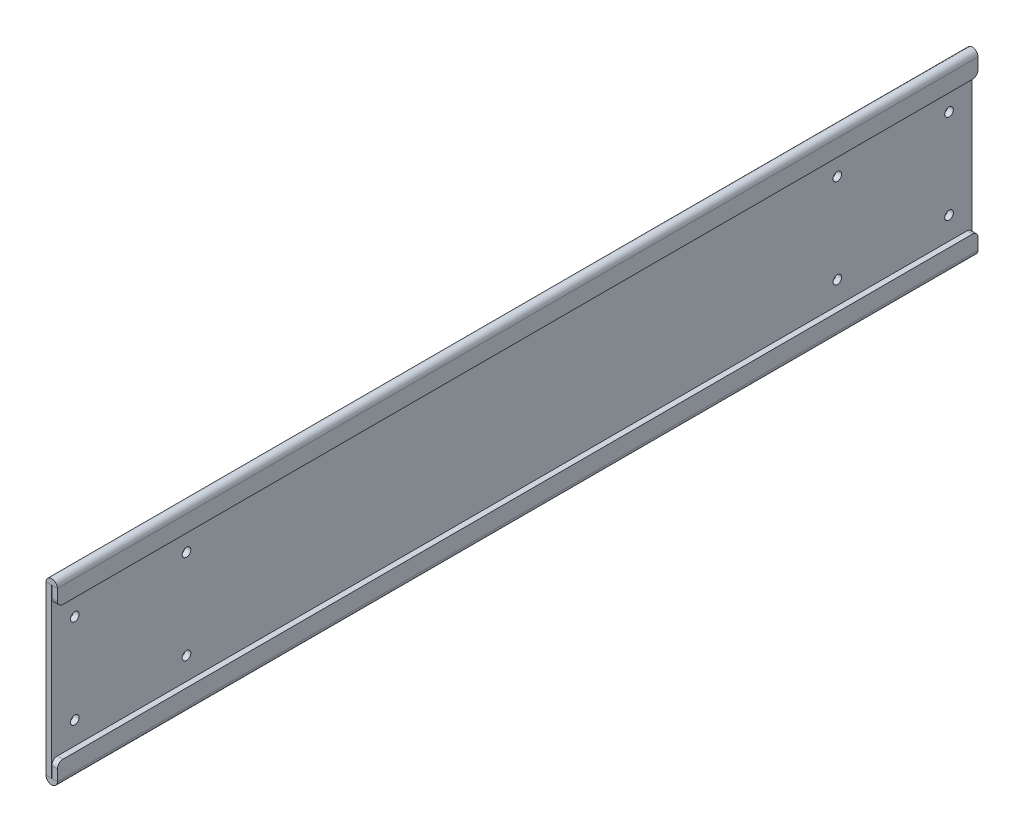
ISO-10303-21;
HEADER;
FILE_DESCRIPTION(('STEP AP214'),'2;1');
FILE_NAME('part.step','',(''),(''),'','','');
FILE_SCHEMA(('AUTOMOTIVE_DESIGN { 1 0 10303 214 1 1 1 1 }'));
ENDSEC;
DATA;
#1=APPLICATION_CONTEXT('core data for automotive mechanical design processes');
#2=APPLICATION_PROTOCOL_DEFINITION('international standard','automotive_design',2000,#1);
#3=PRODUCT_CONTEXT('',#1,'mechanical');
#4=PRODUCT('Part','Part','',(#3));
#5=PRODUCT_RELATED_PRODUCT_CATEGORY('part','',(#4));
#6=PRODUCT_DEFINITION_FORMATION('','',#4);
#7=PRODUCT_DEFINITION_CONTEXT('part definition',#1,'design');
#8=PRODUCT_DEFINITION('design','',#6,#7);
#9=PRODUCT_DEFINITION_SHAPE('','',#8);
#10=(LENGTH_UNIT() NAMED_UNIT(*) SI_UNIT(.MILLI.,.METRE.));
#11=(NAMED_UNIT(*) PLANE_ANGLE_UNIT() SI_UNIT($,.RADIAN.));
#12=(NAMED_UNIT(*) SI_UNIT($,.STERADIAN.) SOLID_ANGLE_UNIT());
#13=UNCERTAINTY_MEASURE_WITH_UNIT(LENGTH_MEASURE(1.E-05),#10,'distance_accuracy_value','');
#14=(GEOMETRIC_REPRESENTATION_CONTEXT(3) GLOBAL_UNCERTAINTY_ASSIGNED_CONTEXT((#13)) GLOBAL_UNIT_ASSIGNED_CONTEXT((#10,
#11,#12)) REPRESENTATION_CONTEXT('',''));
#15=CARTESIAN_POINT('',(0.,0.,0.));
#16=DIRECTION('',(0.,0.,1.));
#17=DIRECTION('',(1.,0.,0.));
#18=AXIS2_PLACEMENT_3D('',#15,#16,#17);
#19=CARTESIAN_POINT('',(-3.175,0.,0.));
#20=DIRECTION('',(0.,0.,-1.));
#21=DIRECTION('',(-1.,0.,0.));
#22=AXIS2_PLACEMENT_3D('',#19,#20,#21);
#23=PLANE('',#22);
#24=DIRECTION('',(0.,1.,0.));
#25=VECTOR('',#24,1.);
#26=CARTESIAN_POINT('',(0.,0.,0.));
#27=LINE('',#26,#25);
#28=CARTESIAN_POINT('',(0.,3.225,0.));
#29=VERTEX_POINT('',#28);
#30=CARTESIAN_POINT('',(0.,98.3749999999999,0.));
#31=VERTEX_POINT('',#30);
#32=EDGE_CURVE('E318',#29,#31,#27,.T.);
#33=ORIENTED_EDGE('',*,*,#32,.F.);
#34=DIRECTION('',(-1.,0.,0.));
#35=VECTOR('',#34,1.);
#36=CARTESIAN_POINT('',(0.,3.225,0.));
#37=LINE('',#36,#35);
#38=CARTESIAN_POINT('',(-3.175,3.225,0.));
#39=VERTEX_POINT('',#38);
#40=EDGE_CURVE('E188',#29,#39,#37,.T.);
#41=ORIENTED_EDGE('',*,*,#40,.T.);
#42=DIRECTION('',(0.,1.,0.));
#43=VECTOR('',#42,1.);
#44=CARTESIAN_POINT('',(-3.175,0.,0.));
#45=LINE('',#44,#43);
#46=CARTESIAN_POINT('',(-3.175,98.3749999999991,0.));
#47=VERTEX_POINT('',#46);
#48=EDGE_CURVE('E167',#39,#47,#45,.T.);
#49=ORIENTED_EDGE('',*,*,#48,.T.);
#50=DIRECTION('',(-1.,-2.7755575615629E-13,0.));
#51=VECTOR('',#50,1.);
#52=CARTESIAN_POINT('',(0.,98.3749999999999,0.));
#53=LINE('',#52,#51);
#54=EDGE_CURVE('E241',#31,#47,#53,.T.);
#55=ORIENTED_EDGE('',*,*,#54,.F.);
#56=EDGE_LOOP('',(#33,#41,#49,#55));
#57=FACE_BOUND('',#56,.T.);
#58=ADVANCED_FACE('F38',(#57),#23,.T.);
#59=CARTESIAN_POINT('',(-3.175,0.,523.3416));
#60=DIRECTION('',(0.,0.,1.));
#61=DIRECTION('',(1.,0.,0.));
#62=AXIS2_PLACEMENT_3D('',#59,#60,#61);
#63=PLANE('',#62);
#64=DIRECTION('',(-1.,0.,0.));
#65=VECTOR('',#64,1.);
#66=CARTESIAN_POINT('',(0.,3.225,523.3416));
#67=LINE('',#66,#65);
#68=CARTESIAN_POINT('',(0.,3.225,523.3416));
#69=VERTEX_POINT('',#68);
#70=CARTESIAN_POINT('',(-3.175,3.22500000000003,523.3416));
#71=VERTEX_POINT('',#70);
#72=EDGE_CURVE('E159',#69,#71,#67,.T.);
#73=ORIENTED_EDGE('',*,*,#72,.F.);
#74=DIRECTION('',(0.,-1.,0.));
#75=VECTOR('',#74,1.);
#76=CARTESIAN_POINT('',(0.,0.,523.3416));
#77=LINE('',#76,#75);
#78=CARTESIAN_POINT('',(0.,98.3749999999999,523.3416));
#79=VERTEX_POINT('',#78);
#80=EDGE_CURVE('E321',#79,#69,#77,.T.);
#81=ORIENTED_EDGE('',*,*,#80,.F.);
#82=DIRECTION('',(-1.,-2.7755575615629E-13,0.));
#83=VECTOR('',#82,1.);
#84=CARTESIAN_POINT('',(0.,98.3749999999999,523.3416));
#85=LINE('',#84,#83);
#86=CARTESIAN_POINT('',(-3.175,98.3749999999999,523.3416));
#87=VERTEX_POINT('',#86);
#88=EDGE_CURVE('E162',#79,#87,#85,.T.);
#89=ORIENTED_EDGE('',*,*,#88,.T.);
#90=DIRECTION('',(0.,-1.,0.));
#91=VECTOR('',#90,1.);
#92=CARTESIAN_POINT('',(-3.175,0.,523.3416));
#93=LINE('',#92,#91);
#94=EDGE_CURVE('E154',#87,#71,#93,.T.);
#95=ORIENTED_EDGE('',*,*,#94,.T.);
#96=EDGE_LOOP('',(#73,#81,#89,#95));
#97=FACE_BOUND('',#96,.T.);
#98=ADVANCED_FACE('F156',(#97),#63,.T.);
#99=CARTESIAN_POINT('',(-3.175,0.,0.));
#100=DIRECTION('',(1.,0.,0.));
#101=DIRECTION('',(0.,0.,-1.));
#102=AXIS2_PLACEMENT_3D('',#99,#100,#101);
#103=PLANE('',#102);
#104=CARTESIAN_POINT('',(-3.175,76.2,13.19149));
#105=DIRECTION('',(1.,0.,0.));
#106=DIRECTION('',(0.,0.,1.));
#107=AXIS2_PLACEMENT_3D('',#104,#105,#106);
#108=CIRCLE('',#107,2.45745000000001);
#109=CARTESIAN_POINT('',(-3.175,76.2,15.64894));
#110=VERTEX_POINT('',#109);
#111=EDGE_CURVE('E273',#110,#110,#108,.T.);
#112=ORIENTED_EDGE('',*,*,#111,.T.);
#113=EDGE_LOOP('',(#112));
#114=FACE_BOUND('',#113,.T.);
#115=CARTESIAN_POINT('',(-3.175,25.4,13.19149));
#116=DIRECTION('',(1.,0.,0.));
#117=DIRECTION('',(0.,0.,1.));
#118=AXIS2_PLACEMENT_3D('',#115,#116,#117);
#119=CIRCLE('',#118,2.45745000000001);
#120=CARTESIAN_POINT('',(-3.175,25.4,15.64894));
#121=VERTEX_POINT('',#120);
#122=EDGE_CURVE('E279',#121,#121,#119,.T.);
#123=ORIENTED_EDGE('',*,*,#122,.T.);
#124=EDGE_LOOP('',(#123));
#125=FACE_BOUND('',#124,.T.);
#126=CARTESIAN_POINT('',(-3.175,25.4,76.69149));
#127=DIRECTION('',(1.,0.,0.));
#128=DIRECTION('',(0.,0.,1.));
#129=AXIS2_PLACEMENT_3D('',#126,#127,#128);
#130=CIRCLE('',#129,2.45745000000001);
#131=CARTESIAN_POINT('',(-3.175,25.4,79.14894));
#132=VERTEX_POINT('',#131);
#133=EDGE_CURVE('E285',#132,#132,#130,.T.);
#134=ORIENTED_EDGE('',*,*,#133,.T.);
#135=EDGE_LOOP('',(#134));
#136=FACE_BOUND('',#135,.T.);
#137=CARTESIAN_POINT('',(-3.175,25.3999999999999,510.15011));
#138=DIRECTION('',(1.,0.,0.));
#139=DIRECTION('',(0.,0.,-1.));
#140=AXIS2_PLACEMENT_3D('',#137,#138,#139);
#141=CIRCLE('',#140,2.45745000000001);
#142=CARTESIAN_POINT('',(-3.175,25.3999999999999,507.69266));
#143=VERTEX_POINT('',#142);
#144=EDGE_CURVE('E291',#143,#143,#141,.T.);
#145=ORIENTED_EDGE('',*,*,#144,.T.);
#146=EDGE_LOOP('',(#145));
#147=FACE_BOUND('',#146,.T.);
#148=CARTESIAN_POINT('',(-3.175,25.3999999999999,446.65011));
#149=DIRECTION('',(1.,0.,0.));
#150=DIRECTION('',(0.,0.,-1.));
#151=AXIS2_PLACEMENT_3D('',#148,#149,#150);
#152=CIRCLE('',#151,2.45745000000002);
#153=CARTESIAN_POINT('',(-3.175,25.3999999999999,444.19266));
#154=VERTEX_POINT('',#153);
#155=EDGE_CURVE('E297',#154,#154,#152,.T.);
#156=ORIENTED_EDGE('',*,*,#155,.T.);
#157=EDGE_LOOP('',(#156));
#158=FACE_BOUND('',#157,.T.);
#159=CARTESIAN_POINT('',(-3.175,76.1999999999999,446.65011));
#160=DIRECTION('',(1.,0.,0.));
#161=DIRECTION('',(0.,0.,-1.));
#162=AXIS2_PLACEMENT_3D('',#159,#160,#161);
#163=CIRCLE('',#162,2.45745000000002);
#164=CARTESIAN_POINT('',(-3.175,76.1999999999999,444.19266));
#165=VERTEX_POINT('',#164);
#166=EDGE_CURVE('E303',#165,#165,#163,.T.);
#167=ORIENTED_EDGE('',*,*,#166,.T.);
#168=EDGE_LOOP('',(#167));
#169=FACE_BOUND('',#168,.T.);
#170=CARTESIAN_POINT('',(-3.175,76.2,76.69149));
#171=DIRECTION('',(1.,0.,0.));
#172=DIRECTION('',(0.,0.,1.));
#173=AXIS2_PLACEMENT_3D('',#170,#171,#172);
#174=CIRCLE('',#173,2.45745000000002);
#175=CARTESIAN_POINT('',(-3.175,76.2,79.14894));
#176=VERTEX_POINT('',#175);
#177=EDGE_CURVE('E309',#176,#176,#174,.T.);
#178=ORIENTED_EDGE('',*,*,#177,.T.);
#179=EDGE_LOOP('',(#178));
#180=FACE_BOUND('',#179,.T.);
#181=CARTESIAN_POINT('',(-3.175,76.1999999999999,510.15011));
#182=DIRECTION('',(1.,0.,0.));
#183=DIRECTION('',(0.,0.,-1.));
#184=AXIS2_PLACEMENT_3D('',#181,#182,#183);
#185=CIRCLE('',#184,2.45745000000001);
#186=CARTESIAN_POINT('',(-3.175,76.1999999999999,507.69266));
#187=VERTEX_POINT('',#186);
#188=EDGE_CURVE('E315',#187,#187,#185,.T.);
#189=ORIENTED_EDGE('',*,*,#188,.T.);
#190=EDGE_LOOP('',(#189));
#191=FACE_BOUND('',#190,.T.);
#192=ORIENTED_EDGE('',*,*,#48,.F.);
#193=DIRECTION('',(0.,0.,-1.));
#194=VECTOR('',#193,1.);
#195=CARTESIAN_POINT('',(-3.175,3.22500000000003,0.));
#196=LINE('',#195,#194);
#197=EDGE_CURVE('E171',#39,#71,#196,.F.);
#198=ORIENTED_EDGE('',*,*,#197,.T.);
#199=ORIENTED_EDGE('',*,*,#94,.F.);
#200=DIRECTION('',(0.,0.,1.));
#201=VECTOR('',#200,1.);
#202=CARTESIAN_POINT('',(-3.175,98.3749999999991,523.3416));
#203=LINE('',#202,#201);
#204=EDGE_CURVE('E225',#87,#47,#203,.F.);
#205=ORIENTED_EDGE('',*,*,#204,.T.);
#206=EDGE_LOOP('',(#192,#198,#199,#205));
#207=FACE_BOUND('',#206,.T.);
#208=ADVANCED_FACE('F172',(#114,#125,#136,#147,#158,#169,#180,#191,#207),#103,.F.);
#209=CARTESIAN_POINT('',(0.,0.,0.));
#210=DIRECTION('',(1.,0.,0.));
#211=DIRECTION('',(0.,0.,-1.));
#212=AXIS2_PLACEMENT_3D('',#209,#210,#211);
#213=PLANE('',#212);
#214=DIRECTION('',(0.,0.,-1.));
#215=VECTOR('',#214,1.);
#216=CARTESIAN_POINT('',(0.,3.225,0.));
#217=LINE('',#216,#215);
#218=EDGE_CURVE('E199',#29,#69,#217,.F.);
#219=ORIENTED_EDGE('',*,*,#218,.F.);
#220=ORIENTED_EDGE('',*,*,#32,.T.);
#221=DIRECTION('',(0.,0.,1.));
#222=VECTOR('',#221,1.);
#223=CARTESIAN_POINT('',(0.,98.3749999999999,523.3416));
#224=LINE('',#223,#222);
#225=EDGE_CURVE('E236',#79,#31,#224,.F.);
#226=ORIENTED_EDGE('',*,*,#225,.F.);
#227=ORIENTED_EDGE('',*,*,#80,.T.);
#228=EDGE_LOOP('',(#219,#220,#226,#227));
#229=FACE_BOUND('',#228,.T.);
#230=CARTESIAN_POINT('',(0.,76.2,13.19149));
#231=DIRECTION('',(1.,0.,0.));
#232=DIRECTION('',(0.,0.,1.));
#233=AXIS2_PLACEMENT_3D('',#230,#231,#232);
#234=CIRCLE('',#233,2.45745000000001);
#235=CARTESIAN_POINT('',(0.,76.2,15.64894));
#236=VERTEX_POINT('',#235);
#237=EDGE_CURVE('E272',#236,#236,#234,.T.);
#238=ORIENTED_EDGE('',*,*,#237,.F.);
#239=EDGE_LOOP('',(#238));
#240=FACE_BOUND('',#239,.T.);
#241=CARTESIAN_POINT('',(0.,25.4,13.19149));
#242=DIRECTION('',(1.,0.,0.));
#243=DIRECTION('',(0.,0.,1.));
#244=AXIS2_PLACEMENT_3D('',#241,#242,#243);
#245=CIRCLE('',#244,2.45745000000001);
#246=CARTESIAN_POINT('',(0.,25.4,15.64894));
#247=VERTEX_POINT('',#246);
#248=EDGE_CURVE('E276',#247,#247,#245,.T.);
#249=ORIENTED_EDGE('',*,*,#248,.F.);
#250=EDGE_LOOP('',(#249));
#251=FACE_BOUND('',#250,.T.);
#252=CARTESIAN_POINT('',(0.,25.4,76.69149));
#253=DIRECTION('',(1.,0.,0.));
#254=DIRECTION('',(0.,0.,1.));
#255=AXIS2_PLACEMENT_3D('',#252,#253,#254);
#256=CIRCLE('',#255,2.45745000000001);
#257=CARTESIAN_POINT('',(0.,25.4,79.14894));
#258=VERTEX_POINT('',#257);
#259=EDGE_CURVE('E282',#258,#258,#256,.T.);
#260=ORIENTED_EDGE('',*,*,#259,.F.);
#261=EDGE_LOOP('',(#260));
#262=FACE_BOUND('',#261,.T.);
#263=CARTESIAN_POINT('',(0.,25.3999999999999,510.15011));
#264=DIRECTION('',(1.,0.,0.));
#265=DIRECTION('',(0.,0.,-1.));
#266=AXIS2_PLACEMENT_3D('',#263,#264,#265);
#267=CIRCLE('',#266,2.45745000000001);
#268=CARTESIAN_POINT('',(0.,25.3999999999999,507.69266));
#269=VERTEX_POINT('',#268);
#270=EDGE_CURVE('E288',#269,#269,#267,.T.);
#271=ORIENTED_EDGE('',*,*,#270,.F.);
#272=EDGE_LOOP('',(#271));
#273=FACE_BOUND('',#272,.T.);
#274=CARTESIAN_POINT('',(0.,25.3999999999999,446.65011));
#275=DIRECTION('',(1.,0.,0.));
#276=DIRECTION('',(0.,0.,-1.));
#277=AXIS2_PLACEMENT_3D('',#274,#275,#276);
#278=CIRCLE('',#277,2.45745000000002);
#279=CARTESIAN_POINT('',(0.,25.3999999999999,444.19266));
#280=VERTEX_POINT('',#279);
#281=EDGE_CURVE('E294',#280,#280,#278,.T.);
#282=ORIENTED_EDGE('',*,*,#281,.F.);
#283=EDGE_LOOP('',(#282));
#284=FACE_BOUND('',#283,.T.);
#285=CARTESIAN_POINT('',(0.,76.1999999999999,446.65011));
#286=DIRECTION('',(1.,0.,0.));
#287=DIRECTION('',(0.,0.,-1.));
#288=AXIS2_PLACEMENT_3D('',#285,#286,#287);
#289=CIRCLE('',#288,2.45745000000002);
#290=CARTESIAN_POINT('',(0.,76.1999999999999,444.19266));
#291=VERTEX_POINT('',#290);
#292=EDGE_CURVE('E300',#291,#291,#289,.T.);
#293=ORIENTED_EDGE('',*,*,#292,.F.);
#294=EDGE_LOOP('',(#293));
#295=FACE_BOUND('',#294,.T.);
#296=CARTESIAN_POINT('',(0.,76.2,76.69149));
#297=DIRECTION('',(1.,0.,0.));
#298=DIRECTION('',(0.,0.,1.));
#299=AXIS2_PLACEMENT_3D('',#296,#297,#298);
#300=CIRCLE('',#299,2.45745000000002);
#301=CARTESIAN_POINT('',(0.,76.2,79.14894));
#302=VERTEX_POINT('',#301);
#303=EDGE_CURVE('E306',#302,#302,#300,.T.);
#304=ORIENTED_EDGE('',*,*,#303,.F.);
#305=EDGE_LOOP('',(#304));
#306=FACE_BOUND('',#305,.T.);
#307=CARTESIAN_POINT('',(0.,76.1999999999999,510.15011));
#308=DIRECTION('',(1.,0.,0.));
#309=DIRECTION('',(0.,0.,-1.));
#310=AXIS2_PLACEMENT_3D('',#307,#308,#309);
#311=CIRCLE('',#310,2.45745000000001);
#312=CARTESIAN_POINT('',(0.,76.1999999999999,507.69266));
#313=VERTEX_POINT('',#312);
#314=EDGE_CURVE('E312',#313,#313,#311,.T.);
#315=ORIENTED_EDGE('',*,*,#314,.F.);
#316=EDGE_LOOP('',(#315));
#317=FACE_BOUND('',#316,.T.);
#318=ADVANCED_FACE('F379',(#229,#240,#251,#262,#273,#284,#295,#306,#317),#213,.T.);
#319=CARTESIAN_POINT('',(-3.175,76.1999999999999,510.15011));
#320=DIRECTION('',(1.,0.,0.));
#321=DIRECTION('',(0.,0.,-1.));
#322=AXIS2_PLACEMENT_3D('',#319,#320,#321);
#323=CYLINDRICAL_SURFACE('',#322,2.45745000000001);
#324=ORIENTED_EDGE('',*,*,#188,.F.);
#325=EDGE_LOOP('',(#324));
#326=FACE_BOUND('',#325,.T.);
#327=ORIENTED_EDGE('',*,*,#314,.T.);
#328=EDGE_LOOP('',(#327));
#329=FACE_BOUND('',#328,.T.);
#330=ADVANCED_FACE('F494',(#326,#329),#323,.F.);
#331=CARTESIAN_POINT('',(-3.175,76.2,76.69149));
#332=DIRECTION('',(1.,0.,0.));
#333=DIRECTION('',(0.,0.,-1.));
#334=AXIS2_PLACEMENT_3D('',#331,#332,#333);
#335=CYLINDRICAL_SURFACE('',#334,2.45745000000002);
#336=ORIENTED_EDGE('',*,*,#177,.F.);
#337=EDGE_LOOP('',(#336));
#338=FACE_BOUND('',#337,.T.);
#339=ORIENTED_EDGE('',*,*,#303,.T.);
#340=EDGE_LOOP('',(#339));
#341=FACE_BOUND('',#340,.T.);
#342=ADVANCED_FACE('F490',(#338,#341),#335,.F.);
#343=CARTESIAN_POINT('',(-3.175,76.1999999999999,446.65011));
#344=DIRECTION('',(1.,0.,0.));
#345=DIRECTION('',(0.,0.,-1.));
#346=AXIS2_PLACEMENT_3D('',#343,#344,#345);
#347=CYLINDRICAL_SURFACE('',#346,2.45745000000002);
#348=ORIENTED_EDGE('',*,*,#166,.F.);
#349=EDGE_LOOP('',(#348));
#350=FACE_BOUND('',#349,.T.);
#351=ORIENTED_EDGE('',*,*,#292,.T.);
#352=EDGE_LOOP('',(#351));
#353=FACE_BOUND('',#352,.T.);
#354=ADVANCED_FACE('F486',(#350,#353),#347,.F.);
#355=CARTESIAN_POINT('',(-3.175,25.3999999999999,446.65011));
#356=DIRECTION('',(1.,0.,0.));
#357=DIRECTION('',(0.,0.,-1.));
#358=AXIS2_PLACEMENT_3D('',#355,#356,#357);
#359=CYLINDRICAL_SURFACE('',#358,2.45745000000002);
#360=ORIENTED_EDGE('',*,*,#155,.F.);
#361=EDGE_LOOP('',(#360));
#362=FACE_BOUND('',#361,.T.);
#363=ORIENTED_EDGE('',*,*,#281,.T.);
#364=EDGE_LOOP('',(#363));
#365=FACE_BOUND('',#364,.T.);
#366=ADVANCED_FACE('F482',(#362,#365),#359,.F.);
#367=CARTESIAN_POINT('',(-3.175,25.3999999999999,510.15011));
#368=DIRECTION('',(1.,0.,0.));
#369=DIRECTION('',(0.,0.,-1.));
#370=AXIS2_PLACEMENT_3D('',#367,#368,#369);
#371=CYLINDRICAL_SURFACE('',#370,2.45745000000001);
#372=ORIENTED_EDGE('',*,*,#144,.F.);
#373=EDGE_LOOP('',(#372));
#374=FACE_BOUND('',#373,.T.);
#375=ORIENTED_EDGE('',*,*,#270,.T.);
#376=EDGE_LOOP('',(#375));
#377=FACE_BOUND('',#376,.T.);
#378=ADVANCED_FACE('F478',(#374,#377),#371,.F.);
#379=CARTESIAN_POINT('',(-3.175,25.4,76.69149));
#380=DIRECTION('',(1.,0.,0.));
#381=DIRECTION('',(0.,0.,-1.));
#382=AXIS2_PLACEMENT_3D('',#379,#380,#381);
#383=CYLINDRICAL_SURFACE('',#382,2.45745000000001);
#384=ORIENTED_EDGE('',*,*,#133,.F.);
#385=EDGE_LOOP('',(#384));
#386=FACE_BOUND('',#385,.T.);
#387=ORIENTED_EDGE('',*,*,#259,.T.);
#388=EDGE_LOOP('',(#387));
#389=FACE_BOUND('',#388,.T.);
#390=ADVANCED_FACE('F474',(#386,#389),#383,.F.);
#391=CARTESIAN_POINT('',(-3.175,25.4,13.19149));
#392=DIRECTION('',(1.,0.,0.));
#393=DIRECTION('',(0.,0.,-1.));
#394=AXIS2_PLACEMENT_3D('',#391,#392,#393);
#395=CYLINDRICAL_SURFACE('',#394,2.45745000000001);
#396=ORIENTED_EDGE('',*,*,#122,.F.);
#397=EDGE_LOOP('',(#396));
#398=FACE_BOUND('',#397,.T.);
#399=ORIENTED_EDGE('',*,*,#248,.T.);
#400=EDGE_LOOP('',(#399));
#401=FACE_BOUND('',#400,.T.);
#402=ADVANCED_FACE('F470',(#398,#401),#395,.F.);
#403=CARTESIAN_POINT('',(-3.175,76.2,13.19149));
#404=DIRECTION('',(1.,0.,0.));
#405=DIRECTION('',(0.,0.,-1.));
#406=AXIS2_PLACEMENT_3D('',#403,#404,#405);
#407=CYLINDRICAL_SURFACE('',#406,2.45745000000001);
#408=ORIENTED_EDGE('',*,*,#111,.F.);
#409=EDGE_LOOP('',(#408));
#410=FACE_BOUND('',#409,.T.);
#411=ORIENTED_EDGE('',*,*,#237,.T.);
#412=EDGE_LOOP('',(#411));
#413=FACE_BOUND('',#412,.T.);
#414=ADVANCED_FACE('F466',(#410,#413),#407,.F.);
#415=CARTESIAN_POINT('',(3.275,93.6374999999999,523.3416));
#416=DIRECTION('',(0.,0.,-1.));
#417=DIRECTION('',(0.,1.,0.));
#418=AXIS2_PLACEMENT_3D('',#415,#416,#417);
#419=PLANE('',#418);
#420=DIRECTION('',(0.,1.,0.));
#421=VECTOR('',#420,1.);
#422=CARTESIAN_POINT('',(0.0999999999999998,93.6375,523.3416));
#423=LINE('',#422,#421);
#424=CARTESIAN_POINT('',(0.0999999999999998,92.0749999999999,523.3416));
#425=VERTEX_POINT('',#424);
#426=CARTESIAN_POINT('',(0.0999999999999998,98.3749999999999,523.3416));
#427=VERTEX_POINT('',#426);
#428=EDGE_CURVE('E261',#425,#427,#423,.T.);
#429=ORIENTED_EDGE('',*,*,#428,.F.);
#430=DIRECTION('',(-1.,0.,0.));
#431=VECTOR('',#430,1.);
#432=CARTESIAN_POINT('',(3.275,92.0749999999999,523.3416));
#433=LINE('',#432,#431);
#434=CARTESIAN_POINT('',(3.275,92.0749999999999,523.3416));
#435=VERTEX_POINT('',#434);
#436=EDGE_CURVE('E11',#425,#435,#433,.F.);
#437=ORIENTED_EDGE('',*,*,#436,.T.);
#438=DIRECTION('',(0.,1.,0.));
#439=VECTOR('',#438,1.);
#440=CARTESIAN_POINT('',(3.275,93.6374999999999,523.3416));
#441=LINE('',#440,#439);
#442=CARTESIAN_POINT('',(3.275,98.3749999999999,523.3416));
#443=VERTEX_POINT('',#442);
#444=EDGE_CURVE('E250',#435,#443,#441,.T.);
#445=ORIENTED_EDGE('',*,*,#444,.T.);
#446=DIRECTION('',(1.,0.,0.));
#447=VECTOR('',#446,1.);
#448=CARTESIAN_POINT('',(3.275,98.3749999999999,523.3416));
#449=LINE('',#448,#447);
#450=EDGE_CURVE('E249',#427,#443,#449,.T.);
#451=ORIENTED_EDGE('',*,*,#450,.F.);
#452=EDGE_LOOP('',(#429,#437,#445,#451));
#453=FACE_BOUND('',#452,.T.);
#454=ADVANCED_FACE('F424',(#453),#419,.F.);
#455=CARTESIAN_POINT('',(3.275,88.8999999999999,261.6708));
#456=DIRECTION('',(0.,1.,0.));
#457=DIRECTION('',(0.,0.,1.));
#458=AXIS2_PLACEMENT_3D('',#455,#456,#457);
#459=PLANE('',#458);
#460=DIRECTION('',(0.,0.,-1.));
#461=VECTOR('',#460,1.);
#462=CARTESIAN_POINT('',(0.0999999999999998,88.9,261.6708));
#463=LINE('',#462,#461);
#464=CARTESIAN_POINT('',(0.0999999999999998,88.9,3.17499999999998));
#465=VERTEX_POINT('',#464);
#466=CARTESIAN_POINT('',(0.0999999999999998,88.9,520.1666));
#467=VERTEX_POINT('',#466);
#468=EDGE_CURVE('E258',#465,#467,#463,.F.);
#469=ORIENTED_EDGE('',*,*,#468,.F.);
#470=DIRECTION('',(-1.,0.,0.));
#471=VECTOR('',#470,1.);
#472=CARTESIAN_POINT('',(3.275,88.9,3.17499999999998));
#473=LINE('',#472,#471);
#474=CARTESIAN_POINT('',(3.275,88.9,3.17499999999998));
#475=VERTEX_POINT('',#474);
#476=EDGE_CURVE('E326',#465,#475,#473,.F.);
#477=ORIENTED_EDGE('',*,*,#476,.T.);
#478=DIRECTION('',(0.,0.,1.));
#479=VECTOR('',#478,1.);
#480=CARTESIAN_POINT('',(3.275,88.8999999999999,261.6708));
#481=LINE('',#480,#479);
#482=CARTESIAN_POINT('',(3.275,88.8999999999999,520.1666));
#483=VERTEX_POINT('',#482);
#484=EDGE_CURVE('E246',#475,#483,#481,.T.);
#485=ORIENTED_EDGE('',*,*,#484,.T.);
#486=DIRECTION('',(-1.,0.,0.));
#487=VECTOR('',#486,1.);
#488=CARTESIAN_POINT('',(3.275,88.8999999999999,520.1666));
#489=LINE('',#488,#487);
#490=EDGE_CURVE('E166',#483,#467,#489,.T.);
#491=ORIENTED_EDGE('',*,*,#490,.T.);
#492=EDGE_LOOP('',(#469,#477,#485,#491));
#493=FACE_BOUND('',#492,.T.);
#494=ADVANCED_FACE('F449',(#493),#459,.F.);
#495=CARTESIAN_POINT('',(3.275,93.6375,0.));
#496=DIRECTION('',(0.,0.,1.));
#497=DIRECTION('',(0.,-1.,0.));
#498=AXIS2_PLACEMENT_3D('',#495,#496,#497);
#499=PLANE('',#498);
#500=DIRECTION('',(0.,-1.,0.));
#501=VECTOR('',#500,1.);
#502=CARTESIAN_POINT('',(3.275,93.6375,0.));
#503=LINE('',#502,#501);
#504=CARTESIAN_POINT('',(3.275,98.3749999999999,0.));
#505=VERTEX_POINT('',#504);
#506=CARTESIAN_POINT('',(3.275,92.075,0.));
#507=VERTEX_POINT('',#506);
#508=EDGE_CURVE('E255',#505,#507,#503,.T.);
#509=ORIENTED_EDGE('',*,*,#508,.T.);
#510=DIRECTION('',(-1.,0.,0.));
#511=VECTOR('',#510,1.);
#512=CARTESIAN_POINT('',(3.275,92.075,0.));
#513=LINE('',#512,#511);
#514=CARTESIAN_POINT('',(0.0999999999999998,92.075,0.));
#515=VERTEX_POINT('',#514);
#516=EDGE_CURVE('E333',#507,#515,#513,.T.);
#517=ORIENTED_EDGE('',*,*,#516,.T.);
#518=DIRECTION('',(0.,1.,0.));
#519=VECTOR('',#518,1.);
#520=CARTESIAN_POINT('',(0.0999999999999998,93.6375,0.));
#521=LINE('',#520,#519);
#522=CARTESIAN_POINT('',(0.0999999999999998,98.375,0.));
#523=VERTEX_POINT('',#522);
#524=EDGE_CURVE('E244',#523,#515,#521,.F.);
#525=ORIENTED_EDGE('',*,*,#524,.F.);
#526=DIRECTION('',(1.,0.,0.));
#527=VECTOR('',#526,1.);
#528=CARTESIAN_POINT('',(3.275,98.375,0.));
#529=LINE('',#528,#527);
#530=EDGE_CURVE('E269',#523,#505,#529,.T.);
#531=ORIENTED_EDGE('',*,*,#530,.T.);
#532=EDGE_LOOP('',(#509,#517,#525,#531));
#533=FACE_BOUND('',#532,.T.);
#534=ADVANCED_FACE('F443',(#533),#499,.F.);
#535=CARTESIAN_POINT('',(3.275,93.6375,261.6708));
#536=DIRECTION('',(1.,0.,0.));
#537=DIRECTION('',(0.,0.,-1.));
#538=AXIS2_PLACEMENT_3D('',#535,#536,#537);
#539=PLANE('',#538);
#540=ORIENTED_EDGE('',*,*,#484,.F.);
#541=CARTESIAN_POINT('',(3.275,92.075,3.17499999999998));
#542=DIRECTION('',(1.,0.,0.));
#543=DIRECTION('',(0.,0.,-1.));
#544=AXIS2_PLACEMENT_3D('',#541,#542,#543);
#545=CIRCLE('',#544,3.175);
#546=EDGE_CURVE('E331',#475,#507,#545,.T.);
#547=ORIENTED_EDGE('',*,*,#546,.T.);
#548=ORIENTED_EDGE('',*,*,#508,.F.);
#549=DIRECTION('',(0.,0.,-1.));
#550=VECTOR('',#549,1.);
#551=CARTESIAN_POINT('',(3.275,98.375,261.6708));
#552=LINE('',#551,#550);
#553=EDGE_CURVE('E252',#443,#505,#552,.T.);
#554=ORIENTED_EDGE('',*,*,#553,.F.);
#555=ORIENTED_EDGE('',*,*,#444,.F.);
#556=CARTESIAN_POINT('',(3.275,92.0749999999999,520.1666));
#557=DIRECTION('',(1.,0.,0.));
#558=DIRECTION('',(0.,0.,-1.));
#559=AXIS2_PLACEMENT_3D('',#556,#557,#558);
#560=CIRCLE('',#559,3.175);
#561=EDGE_CURVE('E329',#435,#483,#560,.T.);
#562=ORIENTED_EDGE('',*,*,#561,.T.);
#563=EDGE_LOOP('',(#540,#547,#548,#554,#555,#562));
#564=FACE_BOUND('',#563,.T.);
#565=ADVANCED_FACE('F451',(#564),#539,.T.);
#566=CARTESIAN_POINT('',(0.0999999999999998,93.6375,261.6708));
#567=DIRECTION('',(1.,0.,0.));
#568=DIRECTION('',(0.,0.,-1.));
#569=AXIS2_PLACEMENT_3D('',#566,#567,#568);
#570=PLANE('',#569);
#571=ORIENTED_EDGE('',*,*,#524,.T.);
#572=CARTESIAN_POINT('',(0.0999999999999998,92.075,3.17499999999998));
#573=DIRECTION('',(1.,0.,0.));
#574=DIRECTION('',(0.,0.,-1.));
#575=AXIS2_PLACEMENT_3D('',#572,#573,#574);
#576=CIRCLE('',#575,3.175);
#577=EDGE_CURVE('E337',#515,#465,#576,.F.);
#578=ORIENTED_EDGE('',*,*,#577,.T.);
#579=ORIENTED_EDGE('',*,*,#468,.T.);
#580=CARTESIAN_POINT('',(0.0999999999999998,92.0749999999999,520.1666));
#581=DIRECTION('',(1.,0.,0.));
#582=DIRECTION('',(0.,0.,-1.));
#583=AXIS2_PLACEMENT_3D('',#580,#581,#582);
#584=CIRCLE('',#583,3.175);
#585=EDGE_CURVE('E335',#467,#425,#584,.F.);
#586=ORIENTED_EDGE('',*,*,#585,.T.);
#587=ORIENTED_EDGE('',*,*,#428,.T.);
#588=DIRECTION('',(0.,0.,-1.));
#589=VECTOR('',#588,1.);
#590=CARTESIAN_POINT('',(0.0999999999999998,98.3749999999999,261.6708));
#591=LINE('',#590,#589);
#592=EDGE_CURVE('E263',#427,#523,#591,.T.);
#593=ORIENTED_EDGE('',*,*,#592,.T.);
#594=EDGE_LOOP('',(#571,#578,#579,#586,#587,#593));
#595=FACE_BOUND('',#594,.T.);
#596=ADVANCED_FACE('F420',(#595),#570,.F.);
#597=CARTESIAN_POINT('',(0.0499999999999999,98.3749999999999,0.));
#598=DIRECTION('',(0.,0.,-1.));
#599=DIRECTION('',(-1.,0.,0.));
#600=AXIS2_PLACEMENT_3D('',#597,#598,#599);
#601=PLANE('',#600);
#602=ORIENTED_EDGE('',*,*,#530,.F.);
#603=CARTESIAN_POINT('',(0.0499999999999999,98.3749999999999,0.));
#604=DIRECTION('',(0.,0.,1.));
#605=DIRECTION('',(1.,0.,0.));
#606=AXIS2_PLACEMENT_3D('',#603,#604,#605);
#607=CIRCLE('',#606,0.0499999999999999);
#608=EDGE_CURVE('E233',#31,#523,#607,.F.);
#609=ORIENTED_EDGE('',*,*,#608,.F.);
#610=ORIENTED_EDGE('',*,*,#54,.T.);
#611=CARTESIAN_POINT('',(0.0499999999999999,98.3749999999999,0.));
#612=DIRECTION('',(0.,0.,1.));
#613=DIRECTION('',(1.,0.,0.));
#614=AXIS2_PLACEMENT_3D('',#611,#612,#613);
#615=CIRCLE('',#614,3.225);
#616=EDGE_CURVE('E227',#47,#505,#615,.F.);
#617=ORIENTED_EDGE('',*,*,#616,.T.);
#618=EDGE_LOOP('',(#602,#609,#610,#617));
#619=FACE_BOUND('',#618,.T.);
#620=ADVANCED_FACE('F441',(#619),#601,.T.);
#621=CARTESIAN_POINT('',(0.0499999999999999,98.3749999999999,523.3416));
#622=DIRECTION('',(0.,0.,-1.));
#623=DIRECTION('',(-1.,0.,0.));
#624=AXIS2_PLACEMENT_3D('',#621,#622,#623);
#625=PLANE('',#624);
#626=CARTESIAN_POINT('',(0.0499999999999999,98.3749999999999,523.3416));
#627=DIRECTION('',(0.,0.,1.));
#628=DIRECTION('',(1.,0.,0.));
#629=AXIS2_PLACEMENT_3D('',#626,#627,#628);
#630=CIRCLE('',#629,0.0499999999999999);
#631=EDGE_CURVE('E224',#427,#79,#630,.T.);
#632=ORIENTED_EDGE('',*,*,#631,.F.);
#633=ORIENTED_EDGE('',*,*,#450,.T.);
#634=CARTESIAN_POINT('',(0.0499999999999999,98.3749999999999,523.3416));
#635=DIRECTION('',(0.,0.,1.));
#636=DIRECTION('',(1.,0.,0.));
#637=AXIS2_PLACEMENT_3D('',#634,#635,#636);
#638=CIRCLE('',#637,3.225);
#639=EDGE_CURVE('E228',#443,#87,#638,.T.);
#640=ORIENTED_EDGE('',*,*,#639,.T.);
#641=ORIENTED_EDGE('',*,*,#88,.F.);
#642=EDGE_LOOP('',(#632,#633,#640,#641));
#643=FACE_BOUND('',#642,.T.);
#644=ADVANCED_FACE('F435',(#643),#625,.F.);
#645=CARTESIAN_POINT('',(0.0499999999999999,98.3749999999999,523.3416));
#646=DIRECTION('',(0.,0.,1.));
#647=DIRECTION('',(1.,0.,0.));
#648=AXIS2_PLACEMENT_3D('',#645,#646,#647);
#649=CYLINDRICAL_SURFACE('',#648,3.225);
#650=ORIENTED_EDGE('',*,*,#204,.F.);
#651=ORIENTED_EDGE('',*,*,#639,.F.);
#652=ORIENTED_EDGE('',*,*,#553,.T.);
#653=ORIENTED_EDGE('',*,*,#616,.F.);
#654=EDGE_LOOP('',(#650,#651,#652,#653));
#655=FACE_BOUND('',#654,.T.);
#656=ADVANCED_FACE('F437',(#655),#649,.T.);
#657=CARTESIAN_POINT('',(0.0499999999999999,98.3749999999999,523.3416));
#658=DIRECTION('',(0.,0.,1.));
#659=DIRECTION('',(1.,0.,0.));
#660=AXIS2_PLACEMENT_3D('',#657,#658,#659);
#661=CYLINDRICAL_SURFACE('',#660,0.0499999999999999);
#662=ORIENTED_EDGE('',*,*,#225,.T.);
#663=ORIENTED_EDGE('',*,*,#608,.T.);
#664=ORIENTED_EDGE('',*,*,#592,.F.);
#665=ORIENTED_EDGE('',*,*,#631,.T.);
#666=EDGE_LOOP('',(#662,#663,#664,#665));
#667=FACE_BOUND('',#666,.T.);
#668=ADVANCED_FACE('F432',(#667),#661,.F.);
#669=CARTESIAN_POINT('',(3.275,7.9625,0.));
#670=DIRECTION('',(0.,0.,1.));
#671=DIRECTION('',(0.,-1.,0.));
#672=AXIS2_PLACEMENT_3D('',#669,#670,#671);
#673=PLANE('',#672);
#674=DIRECTION('',(0.,1.,0.));
#675=VECTOR('',#674,1.);
#676=CARTESIAN_POINT('',(0.0999999999999998,7.9625,0.));
#677=LINE('',#676,#675);
#678=CARTESIAN_POINT('',(0.0999999999999998,9.525,0.));
#679=VERTEX_POINT('',#678);
#680=CARTESIAN_POINT('',(0.0999999999999998,3.225,0.));
#681=VERTEX_POINT('',#680);
#682=EDGE_CURVE('E214',#679,#681,#677,.F.);
#683=ORIENTED_EDGE('',*,*,#682,.F.);
#684=DIRECTION('',(-1.,0.,0.));
#685=VECTOR('',#684,1.);
#686=CARTESIAN_POINT('',(3.275,9.525,0.));
#687=LINE('',#686,#685);
#688=CARTESIAN_POINT('',(3.275,9.525,0.));
#689=VERTEX_POINT('',#688);
#690=EDGE_CURVE('E339',#679,#689,#687,.F.);
#691=ORIENTED_EDGE('',*,*,#690,.T.);
#692=DIRECTION('',(0.,-1.,0.));
#693=VECTOR('',#692,1.);
#694=CARTESIAN_POINT('',(3.275,7.9625,0.));
#695=LINE('',#694,#693);
#696=CARTESIAN_POINT('',(3.275,3.225,0.));
#697=VERTEX_POINT('',#696);
#698=EDGE_CURVE('E207',#689,#697,#695,.T.);
#699=ORIENTED_EDGE('',*,*,#698,.T.);
#700=DIRECTION('',(1.,0.,0.));
#701=VECTOR('',#700,1.);
#702=CARTESIAN_POINT('',(3.275,3.225,0.));
#703=LINE('',#702,#701);
#704=EDGE_CURVE('E206',#681,#697,#703,.T.);
#705=ORIENTED_EDGE('',*,*,#704,.F.);
#706=EDGE_LOOP('',(#683,#691,#699,#705));
#707=FACE_BOUND('',#706,.T.);
#708=ADVANCED_FACE('F361',(#707),#673,.F.);
#709=CARTESIAN_POINT('',(3.275,12.7,261.6708));
#710=DIRECTION('',(0.,-1.,0.));
#711=DIRECTION('',(0.,0.,-1.));
#712=AXIS2_PLACEMENT_3D('',#709,#710,#711);
#713=PLANE('',#712);
#714=DIRECTION('',(0.,0.,-1.));
#715=VECTOR('',#714,1.);
#716=CARTESIAN_POINT('',(3.275,12.7,261.6708));
#717=LINE('',#716,#715);
#718=CARTESIAN_POINT('',(3.275,12.7,520.1666));
#719=VERTEX_POINT('',#718);
#720=CARTESIAN_POINT('',(3.275,12.7,3.17499999999998));
#721=VERTEX_POINT('',#720);
#722=EDGE_CURVE('E204',#719,#721,#717,.T.);
#723=ORIENTED_EDGE('',*,*,#722,.T.);
#724=DIRECTION('',(-1.,0.,0.));
#725=VECTOR('',#724,1.);
#726=CARTESIAN_POINT('',(3.275,12.7,3.17499999999998));
#727=LINE('',#726,#725);
#728=CARTESIAN_POINT('',(0.0999999999999998,12.7,3.17499999999998));
#729=VERTEX_POINT('',#728);
#730=EDGE_CURVE('E60',#721,#729,#727,.T.);
#731=ORIENTED_EDGE('',*,*,#730,.T.);
#732=DIRECTION('',(0.,0.,-1.));
#733=VECTOR('',#732,1.);
#734=CARTESIAN_POINT('',(0.0999999999999998,12.7,261.6708));
#735=LINE('',#734,#733);
#736=CARTESIAN_POINT('',(0.0999999999999998,12.7,520.1666));
#737=VERTEX_POINT('',#736);
#738=EDGE_CURVE('E212',#737,#729,#735,.T.);
#739=ORIENTED_EDGE('',*,*,#738,.F.);
#740=DIRECTION('',(-1.,0.,0.));
#741=VECTOR('',#740,1.);
#742=CARTESIAN_POINT('',(3.275,12.7,520.1666));
#743=LINE('',#742,#741);
#744=EDGE_CURVE('E346',#737,#719,#743,.F.);
#745=ORIENTED_EDGE('',*,*,#744,.T.);
#746=EDGE_LOOP('',(#723,#731,#739,#745));
#747=FACE_BOUND('',#746,.T.);
#748=ADVANCED_FACE('F368',(#747),#713,.F.);
#749=CARTESIAN_POINT('',(3.275,7.9625,523.3416));
#750=DIRECTION('',(0.,0.,-1.));
#751=DIRECTION('',(0.,1.,0.));
#752=AXIS2_PLACEMENT_3D('',#749,#750,#751);
#753=PLANE('',#752);
#754=DIRECTION('',(0.,1.,0.));
#755=VECTOR('',#754,1.);
#756=CARTESIAN_POINT('',(3.275,7.9625,523.3416));
#757=LINE('',#756,#755);
#758=CARTESIAN_POINT('',(3.275,3.225,523.3416));
#759=VERTEX_POINT('',#758);
#760=CARTESIAN_POINT('',(3.275,9.525,523.3416));
#761=VERTEX_POINT('',#760);
#762=EDGE_CURVE('E210',#759,#761,#757,.T.);
#763=ORIENTED_EDGE('',*,*,#762,.T.);
#764=DIRECTION('',(-1.,0.,0.));
#765=VECTOR('',#764,1.);
#766=CARTESIAN_POINT('',(3.275,9.525,523.3416));
#767=LINE('',#766,#765);
#768=CARTESIAN_POINT('',(0.0999999999999998,9.525,523.3416));
#769=VERTEX_POINT('',#768);
#770=EDGE_CURVE('E46',#761,#769,#767,.T.);
#771=ORIENTED_EDGE('',*,*,#770,.T.);
#772=DIRECTION('',(0.,1.,0.));
#773=VECTOR('',#772,1.);
#774=CARTESIAN_POINT('',(0.0999999999999998,7.9625,523.3416));
#775=LINE('',#774,#773);
#776=CARTESIAN_POINT('',(0.0999999999999998,3.225,523.3416));
#777=VERTEX_POINT('',#776);
#778=EDGE_CURVE('E187',#777,#769,#775,.T.);
#779=ORIENTED_EDGE('',*,*,#778,.F.);
#780=DIRECTION('',(1.,0.,0.));
#781=VECTOR('',#780,1.);
#782=CARTESIAN_POINT('',(3.275,3.225,523.3416));
#783=LINE('',#782,#781);
#784=EDGE_CURVE('E221',#777,#759,#783,.T.);
#785=ORIENTED_EDGE('',*,*,#784,.T.);
#786=EDGE_LOOP('',(#763,#771,#779,#785));
#787=FACE_BOUND('',#786,.T.);
#788=ADVANCED_FACE('F373',(#787),#753,.F.);
#789=CARTESIAN_POINT('',(3.275,7.9625,261.6708));
#790=DIRECTION('',(1.,0.,0.));
#791=DIRECTION('',(0.,0.,-1.));
#792=AXIS2_PLACEMENT_3D('',#789,#790,#791);
#793=PLANE('',#792);
#794=ORIENTED_EDGE('',*,*,#698,.F.);
#795=CARTESIAN_POINT('',(3.275,9.525,3.175));
#796=DIRECTION('',(1.,0.,0.));
#797=DIRECTION('',(0.,0.,-1.));
#798=AXIS2_PLACEMENT_3D('',#795,#796,#797);
#799=CIRCLE('',#798,3.175);
#800=EDGE_CURVE('E344',#689,#721,#799,.T.);
#801=ORIENTED_EDGE('',*,*,#800,.T.);
#802=ORIENTED_EDGE('',*,*,#722,.F.);
#803=CARTESIAN_POINT('',(3.275,9.525,520.1666));
#804=DIRECTION('',(1.,0.,0.));
#805=DIRECTION('',(0.,0.,-1.));
#806=AXIS2_PLACEMENT_3D('',#803,#804,#805);
#807=CIRCLE('',#806,3.175);
#808=EDGE_CURVE('E342',#719,#761,#807,.T.);
#809=ORIENTED_EDGE('',*,*,#808,.T.);
#810=ORIENTED_EDGE('',*,*,#762,.F.);
#811=DIRECTION('',(0.,0.,1.));
#812=VECTOR('',#811,1.);
#813=CARTESIAN_POINT('',(3.275,3.225,261.6708));
#814=LINE('',#813,#812);
#815=EDGE_CURVE('E193',#697,#759,#814,.T.);
#816=ORIENTED_EDGE('',*,*,#815,.F.);
#817=EDGE_LOOP('',(#794,#801,#802,#809,#810,#816));
#818=FACE_BOUND('',#817,.T.);
#819=ADVANCED_FACE('F367',(#818),#793,.T.);
#820=CARTESIAN_POINT('',(0.0999999999999998,7.9625,261.6708));
#821=DIRECTION('',(1.,0.,0.));
#822=DIRECTION('',(0.,0.,-1.));
#823=AXIS2_PLACEMENT_3D('',#820,#821,#822);
#824=PLANE('',#823);
#825=ORIENTED_EDGE('',*,*,#738,.T.);
#826=CARTESIAN_POINT('',(0.0999999999999998,9.525,3.175));
#827=DIRECTION('',(1.,0.,0.));
#828=DIRECTION('',(0.,0.,-1.));
#829=AXIS2_PLACEMENT_3D('',#826,#827,#828);
#830=CIRCLE('',#829,3.175);
#831=EDGE_CURVE('E352',#729,#679,#830,.F.);
#832=ORIENTED_EDGE('',*,*,#831,.T.);
#833=ORIENTED_EDGE('',*,*,#682,.T.);
#834=DIRECTION('',(0.,0.,-1.));
#835=VECTOR('',#834,1.);
#836=CARTESIAN_POINT('',(0.0999999999999998,3.225,261.6708));
#837=LINE('',#836,#835);
#838=EDGE_CURVE('E216',#681,#777,#837,.F.);
#839=ORIENTED_EDGE('',*,*,#838,.T.);
#840=ORIENTED_EDGE('',*,*,#778,.T.);
#841=CARTESIAN_POINT('',(0.0999999999999998,9.525,520.1666));
#842=DIRECTION('',(1.,0.,0.));
#843=DIRECTION('',(0.,0.,-1.));
#844=AXIS2_PLACEMENT_3D('',#841,#842,#843);
#845=CIRCLE('',#844,3.175);
#846=EDGE_CURVE('E350',#769,#737,#845,.F.);
#847=ORIENTED_EDGE('',*,*,#846,.T.);
#848=EDGE_LOOP('',(#825,#832,#833,#839,#840,#847));
#849=FACE_BOUND('',#848,.T.);
#850=ADVANCED_FACE('F356',(#849),#824,.F.);
#851=CARTESIAN_POINT('',(0.0499999999999999,3.225,523.3416));
#852=DIRECTION('',(0.,0.,1.));
#853=DIRECTION('',(1.,0.,0.));
#854=AXIS2_PLACEMENT_3D('',#851,#852,#853);
#855=PLANE('',#854);
#856=ORIENTED_EDGE('',*,*,#784,.F.);
#857=CARTESIAN_POINT('',(0.0499999999999999,3.225,523.3416));
#858=DIRECTION('',(0.,0.,-1.));
#859=DIRECTION('',(-1.,0.,0.));
#860=AXIS2_PLACEMENT_3D('',#857,#858,#859);
#861=CIRCLE('',#860,0.0499999999999999);
#862=EDGE_CURVE('E186',#69,#777,#861,.F.);
#863=ORIENTED_EDGE('',*,*,#862,.F.);
#864=ORIENTED_EDGE('',*,*,#72,.T.);
#865=CARTESIAN_POINT('',(0.0499999999999999,3.225,523.3416));
#866=DIRECTION('',(0.,0.,-1.));
#867=DIRECTION('',(-1.,0.,0.));
#868=AXIS2_PLACEMENT_3D('',#865,#866,#867);
#869=CIRCLE('',#868,3.225);
#870=EDGE_CURVE('E177',#71,#759,#869,.F.);
#871=ORIENTED_EDGE('',*,*,#870,.T.);
#872=EDGE_LOOP('',(#856,#863,#864,#871));
#873=FACE_BOUND('',#872,.T.);
#874=ADVANCED_FACE('F184',(#873),#855,.T.);
#875=CARTESIAN_POINT('',(0.0499999999999999,3.225,0.));
#876=DIRECTION('',(0.,0.,1.));
#877=DIRECTION('',(1.,0.,0.));
#878=AXIS2_PLACEMENT_3D('',#875,#876,#877);
#879=PLANE('',#878);
#880=CARTESIAN_POINT('',(0.0499999999999999,3.225,0.));
#881=DIRECTION('',(0.,0.,-1.));
#882=DIRECTION('',(-1.,0.,0.));
#883=AXIS2_PLACEMENT_3D('',#880,#881,#882);
#884=CIRCLE('',#883,0.0499999999999999);
#885=EDGE_CURVE('E201',#681,#29,#884,.T.);
#886=ORIENTED_EDGE('',*,*,#885,.F.);
#887=ORIENTED_EDGE('',*,*,#704,.T.);
#888=CARTESIAN_POINT('',(0.0499999999999999,3.225,0.));
#889=DIRECTION('',(0.,0.,-1.));
#890=DIRECTION('',(-1.,0.,0.));
#891=AXIS2_PLACEMENT_3D('',#888,#889,#890);
#892=CIRCLE('',#891,3.225);
#893=EDGE_CURVE('E178',#697,#39,#892,.T.);
#894=ORIENTED_EDGE('',*,*,#893,.T.);
#895=ORIENTED_EDGE('',*,*,#40,.F.);
#896=EDGE_LOOP('',(#886,#887,#894,#895));
#897=FACE_BOUND('',#896,.T.);
#898=ADVANCED_FACE('F385',(#897),#879,.F.);
#899=CARTESIAN_POINT('',(0.0499999999999999,3.225,0.));
#900=DIRECTION('',(0.,0.,-1.));
#901=DIRECTION('',(1.,0.,0.));
#902=AXIS2_PLACEMENT_3D('',#899,#900,#901);
#903=CYLINDRICAL_SURFACE('',#902,3.225);
#904=ORIENTED_EDGE('',*,*,#197,.F.);
#905=ORIENTED_EDGE('',*,*,#893,.F.);
#906=ORIENTED_EDGE('',*,*,#815,.T.);
#907=ORIENTED_EDGE('',*,*,#870,.F.);
#908=EDGE_LOOP('',(#904,#905,#906,#907));
#909=FACE_BOUND('',#908,.T.);
#910=ADVANCED_FACE('F191',(#909),#903,.T.);
#911=CARTESIAN_POINT('',(0.0499999999999999,3.225,0.));
#912=DIRECTION('',(0.,0.,-1.));
#913=DIRECTION('',(1.,0.,0.));
#914=AXIS2_PLACEMENT_3D('',#911,#912,#913);
#915=CYLINDRICAL_SURFACE('',#914,0.0499999999999999);
#916=ORIENTED_EDGE('',*,*,#218,.T.);
#917=ORIENTED_EDGE('',*,*,#862,.T.);
#918=ORIENTED_EDGE('',*,*,#838,.F.);
#919=ORIENTED_EDGE('',*,*,#885,.T.);
#920=EDGE_LOOP('',(#916,#917,#918,#919));
#921=FACE_BOUND('',#920,.T.);
#922=ADVANCED_FACE('F375',(#921),#915,.F.);
#923=CARTESIAN_POINT('',(3.275,92.075,3.17499999999998));
#924=DIRECTION('',(1.,0.,0.));
#925=DIRECTION('',(0.,0.,-1.));
#926=AXIS2_PLACEMENT_3D('',#923,#924,#925);
#927=CYLINDRICAL_SURFACE('',#926,3.175);
#928=ORIENTED_EDGE('',*,*,#577,.F.);
#929=ORIENTED_EDGE('',*,*,#516,.F.);
#930=ORIENTED_EDGE('',*,*,#546,.F.);
#931=ORIENTED_EDGE('',*,*,#476,.F.);
#932=EDGE_LOOP('',(#928,#929,#930,#931));
#933=FACE_BOUND('',#932,.T.);
#934=ADVANCED_FACE('F403',(#933),#927,.T.);
#935=CARTESIAN_POINT('',(3.275,9.525,3.175));
#936=DIRECTION('',(1.,0.,0.));
#937=DIRECTION('',(0.,0.,-1.));
#938=AXIS2_PLACEMENT_3D('',#935,#936,#937);
#939=CYLINDRICAL_SURFACE('',#938,3.175);
#940=ORIENTED_EDGE('',*,*,#831,.F.);
#941=ORIENTED_EDGE('',*,*,#730,.F.);
#942=ORIENTED_EDGE('',*,*,#800,.F.);
#943=ORIENTED_EDGE('',*,*,#690,.F.);
#944=EDGE_LOOP('',(#940,#941,#942,#943));
#945=FACE_BOUND('',#944,.T.);
#946=ADVANCED_FACE('F364',(#945),#939,.T.);
#947=CARTESIAN_POINT('',(3.275,9.525,520.1666));
#948=DIRECTION('',(1.,0.,0.));
#949=DIRECTION('',(0.,0.,-1.));
#950=AXIS2_PLACEMENT_3D('',#947,#948,#949);
#951=CYLINDRICAL_SURFACE('',#950,3.175);
#952=ORIENTED_EDGE('',*,*,#846,.F.);
#953=ORIENTED_EDGE('',*,*,#770,.F.);
#954=ORIENTED_EDGE('',*,*,#808,.F.);
#955=ORIENTED_EDGE('',*,*,#744,.F.);
#956=EDGE_LOOP('',(#952,#953,#954,#955));
#957=FACE_BOUND('',#956,.T.);
#958=ADVANCED_FACE('F372',(#957),#951,.T.);
#959=CARTESIAN_POINT('',(3.275,92.0749999999999,520.1666));
#960=DIRECTION('',(1.,0.,0.));
#961=DIRECTION('',(0.,0.,-1.));
#962=AXIS2_PLACEMENT_3D('',#959,#960,#961);
#963=CYLINDRICAL_SURFACE('',#962,3.175);
#964=ORIENTED_EDGE('',*,*,#585,.F.);
#965=ORIENTED_EDGE('',*,*,#490,.F.);
#966=ORIENTED_EDGE('',*,*,#561,.F.);
#967=ORIENTED_EDGE('',*,*,#436,.F.);
#968=EDGE_LOOP('',(#964,#965,#966,#967));
#969=FACE_BOUND('',#968,.T.);
#970=ADVANCED_FACE('F40',(#969),#963,.T.);
#971=CLOSED_SHELL('',(#58,#98,#208,#318,#330,#342,#354,#366,#378,#390,#402,#414,#454,#494,#534,
#565,#596,#620,#644,#656,#668,#708,#748,#788,#819,#850,#874,#898,#910,#922,#934,#946,#958,#970));
#972=MANIFOLD_SOLID_BREP('B2',#971);
#973=ADVANCED_BREP_SHAPE_REPRESENTATION('',(#18,#972),#14);
#974=SHAPE_DEFINITION_REPRESENTATION(#9,#973);
ENDSEC;
END-ISO-10303-21;
